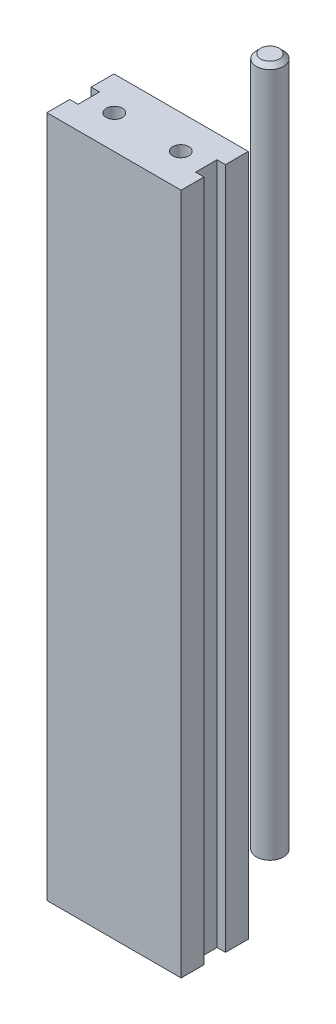
ISO-10303-21;
HEADER;
FILE_DESCRIPTION(('STEP AP214'),'2;1');
FILE_NAME('part.step','',(''),(''),'','','');
FILE_SCHEMA(('AUTOMOTIVE_DESIGN { 1 0 10303 214 1 1 1 1 }'));
ENDSEC;
DATA;
#1=APPLICATION_CONTEXT('core data for automotive mechanical design processes');
#2=APPLICATION_PROTOCOL_DEFINITION('international standard','automotive_design',2000,#1);
#3=PRODUCT_CONTEXT('',#1,'mechanical');
#4=PRODUCT('Part','Part','',(#3));
#5=PRODUCT_RELATED_PRODUCT_CATEGORY('part','',(#4));
#6=PRODUCT_DEFINITION_FORMATION('','',#4);
#7=PRODUCT_DEFINITION_CONTEXT('part definition',#1,'design');
#8=PRODUCT_DEFINITION('design','',#6,#7);
#9=PRODUCT_DEFINITION_SHAPE('','',#8);
#10=(LENGTH_UNIT() NAMED_UNIT(*) SI_UNIT(.MILLI.,.METRE.));
#11=(NAMED_UNIT(*) PLANE_ANGLE_UNIT() SI_UNIT($,.RADIAN.));
#12=(NAMED_UNIT(*) SI_UNIT($,.STERADIAN.) SOLID_ANGLE_UNIT());
#13=UNCERTAINTY_MEASURE_WITH_UNIT(LENGTH_MEASURE(1.E-05),#10,'distance_accuracy_value','');
#14=(GEOMETRIC_REPRESENTATION_CONTEXT(3) GLOBAL_UNCERTAINTY_ASSIGNED_CONTEXT((#13)) GLOBAL_UNIT_ASSIGNED_CONTEXT((#10,
#11,#12)) REPRESENTATION_CONTEXT('',''));
#15=CARTESIAN_POINT('',(0.,0.,0.));
#16=DIRECTION('',(0.,0.,1.));
#17=DIRECTION('',(1.,0.,0.));
#18=AXIS2_PLACEMENT_3D('',#15,#16,#17);
#19=CARTESIAN_POINT('',(0.,103.6,-36.45));
#20=DIRECTION('',(0.,-1.,0.));
#21=DIRECTION('',(0.,0.,-1.));
#22=AXIS2_PLACEMENT_3D('',#19,#20,#21);
#23=CYLINDRICAL_SURFACE('',#22,4.05);
#24=CARTESIAN_POINT('',(0.,102.33,-36.45));
#25=DIRECTION('',(0.,1.,0.));
#26=DIRECTION('',(0.,0.,1.));
#27=AXIS2_PLACEMENT_3D('',#24,#25,#26);
#28=CIRCLE('',#27,4.05);
#29=CARTESIAN_POINT('',(0.,102.33,-32.4));
#30=VERTEX_POINT('',#29);
#31=EDGE_CURVE('E11',#30,#30,#28,.F.);
#32=ORIENTED_EDGE('',*,*,#31,.T.);
#33=EDGE_LOOP('',(#32));
#34=FACE_BOUND('',#33,.T.);
#35=CARTESIAN_POINT('',(0.,-101.6,-36.45));
#36=DIRECTION('',(0.,1.,0.));
#37=DIRECTION('',(0.,0.,1.));
#38=AXIS2_PLACEMENT_3D('',#35,#36,#37);
#39=CIRCLE('',#38,4.05);
#40=CARTESIAN_POINT('',(0.,-101.6,-32.4));
#41=VERTEX_POINT('',#40);
#42=EDGE_CURVE('E61',#41,#41,#39,.F.);
#43=ORIENTED_EDGE('',*,*,#42,.F.);
#44=EDGE_LOOP('',(#43));
#45=FACE_BOUND('',#44,.T.);
#46=ADVANCED_FACE('F49',(#34,#45),#23,.T.);
#47=CARTESIAN_POINT('',(0.,103.6,-36.45));
#48=DIRECTION('',(0.,1.,0.));
#49=DIRECTION('',(0.,0.,1.));
#50=AXIS2_PLACEMENT_3D('',#47,#48,#49);
#51=PLANE('',#50);
#52=CARTESIAN_POINT('',(0.,103.6,-36.45));
#53=DIRECTION('',(0.,1.,0.));
#54=DIRECTION('',(0.,0.,1.));
#55=AXIS2_PLACEMENT_3D('',#52,#53,#54);
#56=CIRCLE('',#55,2.78);
#57=CARTESIAN_POINT('',(0.,103.6,-33.67));
#58=VERTEX_POINT('',#57);
#59=EDGE_CURVE('E57',#58,#58,#56,.T.);
#60=ORIENTED_EDGE('',*,*,#59,.T.);
#61=EDGE_LOOP('',(#60));
#62=FACE_BOUND('',#61,.T.);
#63=ADVANCED_FACE('F71',(#62),#51,.T.);
#64=CARTESIAN_POINT('',(0.,-101.6,0.));
#65=DIRECTION('',(0.,1.,0.));
#66=DIRECTION('',(0.,0.,1.));
#67=AXIS2_PLACEMENT_3D('',#64,#65,#66);
#68=PLANE('',#67);
#69=ORIENTED_EDGE('',*,*,#42,.T.);
#70=EDGE_LOOP('',(#69));
#71=FACE_BOUND('',#70,.T.);
#72=ADVANCED_FACE('F68',(#71),#68,.F.);
#73=CARTESIAN_POINT('',(0.,103.6,-36.45));
#74=DIRECTION('',(0.,-1.,0.));
#75=DIRECTION('',(0.,0.,-1.));
#76=AXIS2_PLACEMENT_3D('',#73,#74,#75);
#77=CONICAL_SURFACE('',#76,2.78,0.785398163397449);
#78=ORIENTED_EDGE('',*,*,#31,.F.);
#79=EDGE_LOOP('',(#78));
#80=FACE_BOUND('',#79,.T.);
#81=ORIENTED_EDGE('',*,*,#59,.F.);
#82=EDGE_LOOP('',(#81));
#83=FACE_BOUND('',#82,.T.);
#84=ADVANCED_FACE('F52',(#80,#83),#77,.T.);
#85=CLOSED_SHELL('',(#46,#63,#72,#84));
#86=MANIFOLD_SOLID_BREP('B2',#85);
#87=CARTESIAN_POINT('',(-20.,101.6,-10.));
#88=DIRECTION('',(1.,0.,0.));
#89=DIRECTION('',(0.,0.,-1.));
#90=AXIS2_PLACEMENT_3D('',#87,#88,#89);
#91=PLANE('',#90);
#92=DIRECTION('',(0.,0.,1.));
#93=VECTOR('',#92,1.);
#94=CARTESIAN_POINT('',(-20.,-101.6,-10.));
#95=LINE('',#94,#93);
#96=CARTESIAN_POINT('',(-20.,-101.6,-10.));
#97=VERTEX_POINT('',#96);
#98=CARTESIAN_POINT('',(-20.,-101.6,-3.2));
#99=VERTEX_POINT('',#98);
#100=EDGE_CURVE('E218',#97,#99,#95,.T.);
#101=ORIENTED_EDGE('',*,*,#100,.T.);
#102=DIRECTION('',(0.,1.,0.));
#103=VECTOR('',#102,1.);
#104=CARTESIAN_POINT('',(-20.,-101.6,-3.2));
#105=LINE('',#104,#103);
#106=CARTESIAN_POINT('',(-20.,101.6,-3.2));
#107=VERTEX_POINT('',#106);
#108=EDGE_CURVE('E219',#99,#107,#105,.T.);
#109=ORIENTED_EDGE('',*,*,#108,.T.);
#110=DIRECTION('',(0.,0.,1.));
#111=VECTOR('',#110,1.);
#112=CARTESIAN_POINT('',(-20.,101.6,-10.));
#113=LINE('',#112,#111);
#114=CARTESIAN_POINT('',(-20.,101.6,-10.));
#115=VERTEX_POINT('',#114);
#116=EDGE_CURVE('E267',#115,#107,#113,.T.);
#117=ORIENTED_EDGE('',*,*,#116,.F.);
#118=DIRECTION('',(0.,-1.,0.));
#119=VECTOR('',#118,1.);
#120=CARTESIAN_POINT('',(-20.,101.6,-10.));
#121=LINE('',#120,#119);
#122=EDGE_CURVE('E236',#115,#97,#121,.T.);
#123=ORIENTED_EDGE('',*,*,#122,.T.);
#124=EDGE_LOOP('',(#101,#109,#117,#123));
#125=FACE_BOUND('',#124,.T.);
#126=ADVANCED_FACE('F108',(#125),#91,.F.);
#127=CARTESIAN_POINT('',(20.,101.6,-10.));
#128=DIRECTION('',(-1.,0.,0.));
#129=DIRECTION('',(0.,0.,1.));
#130=AXIS2_PLACEMENT_3D('',#127,#128,#129);
#131=PLANE('',#130);
#132=DIRECTION('',(0.,0.,-1.));
#133=VECTOR('',#132,1.);
#134=CARTESIAN_POINT('',(20.,101.6,-10.));
#135=LINE('',#134,#133);
#136=CARTESIAN_POINT('',(20.,101.6,-3.20000000000001));
#137=VERTEX_POINT('',#136);
#138=CARTESIAN_POINT('',(20.,101.6,-10.));
#139=VERTEX_POINT('',#138);
#140=EDGE_CURVE('E271',#137,#139,#135,.T.);
#141=ORIENTED_EDGE('',*,*,#140,.F.);
#142=DIRECTION('',(0.,1.,0.));
#143=VECTOR('',#142,1.);
#144=CARTESIAN_POINT('',(20.,-101.6,-3.20000000000001));
#145=LINE('',#144,#143);
#146=CARTESIAN_POINT('',(20.,-101.6,-3.20000000000001));
#147=VERTEX_POINT('',#146);
#148=EDGE_CURVE('E307',#147,#137,#145,.T.);
#149=ORIENTED_EDGE('',*,*,#148,.F.);
#150=DIRECTION('',(0.,0.,-1.));
#151=VECTOR('',#150,1.);
#152=CARTESIAN_POINT('',(20.,-101.6,-10.));
#153=LINE('',#152,#151);
#154=CARTESIAN_POINT('',(20.,-101.6,-10.));
#155=VERTEX_POINT('',#154);
#156=EDGE_CURVE('E230',#147,#155,#153,.T.);
#157=ORIENTED_EDGE('',*,*,#156,.T.);
#158=DIRECTION('',(0.,-1.,0.));
#159=VECTOR('',#158,1.);
#160=CARTESIAN_POINT('',(20.,101.6,-10.));
#161=LINE('',#160,#159);
#162=EDGE_CURVE('E239',#139,#155,#161,.T.);
#163=ORIENTED_EDGE('',*,*,#162,.F.);
#164=EDGE_LOOP('',(#141,#149,#157,#163));
#165=FACE_BOUND('',#164,.T.);
#166=ADVANCED_FACE('F285',(#165),#131,.F.);
#167=CARTESIAN_POINT('',(-20.,101.6,3.2));
#168=VERTEX_POINT('',#167);
#169=CARTESIAN_POINT('',(-20.,101.6,10.));
#170=VERTEX_POINT('',#169);
#171=EDGE_CURVE('E212',#168,#170,#113,.T.);
#172=ORIENTED_EDGE('',*,*,#171,.F.);
#173=DIRECTION('',(0.,1.,0.));
#174=VECTOR('',#173,1.);
#175=CARTESIAN_POINT('',(-20.,-101.6,3.2));
#176=LINE('',#175,#174);
#177=CARTESIAN_POINT('',(-20.,-101.6,3.2));
#178=VERTEX_POINT('',#177);
#179=EDGE_CURVE('E200',#178,#168,#176,.T.);
#180=ORIENTED_EDGE('',*,*,#179,.F.);
#181=CARTESIAN_POINT('',(-20.,-101.6,10.));
#182=VERTEX_POINT('',#181);
#183=EDGE_CURVE('E210',#178,#182,#95,.T.);
#184=ORIENTED_EDGE('',*,*,#183,.T.);
#185=DIRECTION('',(0.,-1.,0.));
#186=VECTOR('',#185,1.);
#187=CARTESIAN_POINT('',(-20.,101.6,10.));
#188=LINE('',#187,#186);
#189=EDGE_CURVE('E47',#170,#182,#188,.T.);
#190=ORIENTED_EDGE('',*,*,#189,.F.);
#191=EDGE_LOOP('',(#172,#180,#184,#190));
#192=FACE_BOUND('',#191,.T.);
#193=ADVANCED_FACE('F110',(#192),#91,.F.);
#194=CARTESIAN_POINT('',(-20.,101.6,10.));
#195=DIRECTION('',(0.,0.,-1.));
#196=DIRECTION('',(-1.,0.,0.));
#197=AXIS2_PLACEMENT_3D('',#194,#195,#196);
#198=PLANE('',#197);
#199=DIRECTION('',(1.,0.,0.));
#200=VECTOR('',#199,1.);
#201=CARTESIAN_POINT('',(-20.,-101.6,10.));
#202=LINE('',#201,#200);
#203=CARTESIAN_POINT('',(20.,-101.6,10.));
#204=VERTEX_POINT('',#203);
#205=EDGE_CURVE('E217',#182,#204,#202,.T.);
#206=ORIENTED_EDGE('',*,*,#205,.T.);
#207=DIRECTION('',(0.,-1.,0.));
#208=VECTOR('',#207,1.);
#209=CARTESIAN_POINT('',(20.,101.6,10.));
#210=LINE('',#209,#208);
#211=CARTESIAN_POINT('',(20.,101.6,10.));
#212=VERTEX_POINT('',#211);
#213=EDGE_CURVE('E116',#212,#204,#210,.T.);
#214=ORIENTED_EDGE('',*,*,#213,.F.);
#215=DIRECTION('',(1.,0.,0.));
#216=VECTOR('',#215,1.);
#217=CARTESIAN_POINT('',(-20.,101.6,10.));
#218=LINE('',#217,#216);
#219=EDGE_CURVE('E270',#170,#212,#218,.T.);
#220=ORIENTED_EDGE('',*,*,#219,.F.);
#221=ORIENTED_EDGE('',*,*,#189,.T.);
#222=EDGE_LOOP('',(#206,#214,#220,#221));
#223=FACE_BOUND('',#222,.T.);
#224=ADVANCED_FACE('F362',(#223),#198,.F.);
#225=CARTESIAN_POINT('',(20.,-101.6,3.2));
#226=VERTEX_POINT('',#225);
#227=EDGE_CURVE('E231',#204,#226,#153,.T.);
#228=ORIENTED_EDGE('',*,*,#227,.T.);
#229=DIRECTION('',(0.,1.,0.));
#230=VECTOR('',#229,1.);
#231=CARTESIAN_POINT('',(20.,-101.6,3.2));
#232=LINE('',#231,#230);
#233=CARTESIAN_POINT('',(20.,101.6,3.2));
#234=VERTEX_POINT('',#233);
#235=EDGE_CURVE('E305',#226,#234,#232,.T.);
#236=ORIENTED_EDGE('',*,*,#235,.T.);
#237=EDGE_CURVE('E248',#212,#234,#135,.T.);
#238=ORIENTED_EDGE('',*,*,#237,.F.);
#239=ORIENTED_EDGE('',*,*,#213,.T.);
#240=EDGE_LOOP('',(#228,#236,#238,#239));
#241=FACE_BOUND('',#240,.T.);
#242=ADVANCED_FACE('F245',(#241),#131,.F.);
#243=CARTESIAN_POINT('',(-20.,101.6,-10.));
#244=DIRECTION('',(0.,0.,1.));
#245=DIRECTION('',(1.,0.,0.));
#246=AXIS2_PLACEMENT_3D('',#243,#244,#245);
#247=PLANE('',#246);
#248=DIRECTION('',(-1.,0.,0.));
#249=VECTOR('',#248,1.);
#250=CARTESIAN_POINT('',(-20.,-101.6,-10.));
#251=LINE('',#250,#249);
#252=EDGE_CURVE('E234',#155,#97,#251,.T.);
#253=ORIENTED_EDGE('',*,*,#252,.T.);
#254=ORIENTED_EDGE('',*,*,#122,.F.);
#255=DIRECTION('',(-1.,0.,0.));
#256=VECTOR('',#255,1.);
#257=CARTESIAN_POINT('',(-20.,101.6,-10.));
#258=LINE('',#257,#256);
#259=EDGE_CURVE('E227',#139,#115,#258,.T.);
#260=ORIENTED_EDGE('',*,*,#259,.F.);
#261=ORIENTED_EDGE('',*,*,#162,.T.);
#262=EDGE_LOOP('',(#253,#254,#260,#261));
#263=FACE_BOUND('',#262,.T.);
#264=ADVANCED_FACE('F289',(#263),#247,.F.);
#265=CARTESIAN_POINT('',(0.,101.6,0.));
#266=DIRECTION('',(0.,1.,0.));
#267=DIRECTION('',(0.,0.,1.));
#268=AXIS2_PLACEMENT_3D('',#265,#266,#267);
#269=PLANE('',#268);
#270=CARTESIAN_POINT('',(-9.9,101.6,0.));
#271=DIRECTION('',(0.,1.,0.));
#272=DIRECTION('',(0.,0.,1.));
#273=AXIS2_PLACEMENT_3D('',#270,#271,#272);
#274=CIRCLE('',#273,2.4);
#275=CARTESIAN_POINT('',(-9.9,101.6,2.4));
#276=VERTEX_POINT('',#275);
#277=EDGE_CURVE('E324',#276,#276,#274,.T.);
#278=ORIENTED_EDGE('',*,*,#277,.F.);
#279=EDGE_LOOP('',(#278));
#280=FACE_BOUND('',#279,.T.);
#281=CARTESIAN_POINT('',(9.9,101.6,0.));
#282=DIRECTION('',(0.,1.,0.));
#283=DIRECTION('',(0.,0.,1.));
#284=AXIS2_PLACEMENT_3D('',#281,#282,#283);
#285=CIRCLE('',#284,2.4);
#286=CARTESIAN_POINT('',(9.9,101.6,2.4));
#287=VERTEX_POINT('',#286);
#288=EDGE_CURVE('E321',#287,#287,#285,.T.);
#289=ORIENTED_EDGE('',*,*,#288,.F.);
#290=EDGE_LOOP('',(#289));
#291=FACE_BOUND('',#290,.T.);
#292=DIRECTION('',(-1.,0.,0.));
#293=VECTOR('',#292,1.);
#294=CARTESIAN_POINT('',(-20.,101.6,-3.2));
#295=LINE('',#294,#293);
#296=CARTESIAN_POINT('',(-17.5,101.6,-3.2));
#297=VERTEX_POINT('',#296);
#298=EDGE_CURVE('E205',#297,#107,#295,.T.);
#299=ORIENTED_EDGE('',*,*,#298,.F.);
#300=DIRECTION('',(0.,0.,-1.));
#301=VECTOR('',#300,1.);
#302=CARTESIAN_POINT('',(-17.5,101.6,-3.2));
#303=LINE('',#302,#301);
#304=CARTESIAN_POINT('',(-17.5,101.6,3.2));
#305=VERTEX_POINT('',#304);
#306=EDGE_CURVE('E295',#305,#297,#303,.T.);
#307=ORIENTED_EDGE('',*,*,#306,.F.);
#308=DIRECTION('',(1.,0.,0.));
#309=VECTOR('',#308,1.);
#310=CARTESIAN_POINT('',(-20.,101.6,3.2));
#311=LINE('',#310,#309);
#312=EDGE_CURVE('E298',#168,#305,#311,.T.);
#313=ORIENTED_EDGE('',*,*,#312,.F.);
#314=ORIENTED_EDGE('',*,*,#171,.T.);
#315=ORIENTED_EDGE('',*,*,#219,.T.);
#316=ORIENTED_EDGE('',*,*,#237,.T.);
#317=DIRECTION('',(1.,0.,0.));
#318=VECTOR('',#317,1.);
#319=CARTESIAN_POINT('',(20.,101.6,3.2));
#320=LINE('',#319,#318);
#321=CARTESIAN_POINT('',(17.5,101.6,3.2));
#322=VERTEX_POINT('',#321);
#323=EDGE_CURVE('E266',#322,#234,#320,.T.);
#324=ORIENTED_EDGE('',*,*,#323,.F.);
#325=DIRECTION('',(0.,0.,1.));
#326=VECTOR('',#325,1.);
#327=CARTESIAN_POINT('',(17.5,101.6,-3.2));
#328=LINE('',#327,#326);
#329=CARTESIAN_POINT('',(17.5,101.6,-3.2));
#330=VERTEX_POINT('',#329);
#331=EDGE_CURVE('E310',#330,#322,#328,.T.);
#332=ORIENTED_EDGE('',*,*,#331,.F.);
#333=DIRECTION('',(-1.,0.,0.));
#334=VECTOR('',#333,1.);
#335=CARTESIAN_POINT('',(20.,101.6,-3.20000000000001));
#336=LINE('',#335,#334);
#337=EDGE_CURVE('E262',#137,#330,#336,.T.);
#338=ORIENTED_EDGE('',*,*,#337,.F.);
#339=ORIENTED_EDGE('',*,*,#140,.T.);
#340=ORIENTED_EDGE('',*,*,#259,.T.);
#341=ORIENTED_EDGE('',*,*,#116,.T.);
#342=EDGE_LOOP('',(#299,#307,#313,#314,#315,#316,#324,#332,#338,#339,#340,#341));
#343=FACE_BOUND('',#342,.T.);
#344=ADVANCED_FACE('F278',(#280,#291,#343),#269,.T.);
#345=CARTESIAN_POINT('',(0.,-101.6,0.));
#346=DIRECTION('',(0.,1.,0.));
#347=DIRECTION('',(0.,0.,1.));
#348=AXIS2_PLACEMENT_3D('',#345,#346,#347);
#349=PLANE('',#348);
#350=CARTESIAN_POINT('',(-9.9,-101.6,0.));
#351=DIRECTION('',(0.,1.,0.));
#352=DIRECTION('',(0.,0.,1.));
#353=AXIS2_PLACEMENT_3D('',#350,#351,#352);
#354=CIRCLE('',#353,2.4);
#355=CARTESIAN_POINT('',(-9.9,-101.6,2.4));
#356=VERTEX_POINT('',#355);
#357=EDGE_CURVE('E309',#356,#356,#354,.T.);
#358=ORIENTED_EDGE('',*,*,#357,.T.);
#359=EDGE_LOOP('',(#358));
#360=FACE_BOUND('',#359,.T.);
#361=CARTESIAN_POINT('',(9.9,-101.6,0.));
#362=DIRECTION('',(0.,1.,0.));
#363=DIRECTION('',(0.,0.,1.));
#364=AXIS2_PLACEMENT_3D('',#361,#362,#363);
#365=CIRCLE('',#364,2.4);
#366=CARTESIAN_POINT('',(9.9,-101.6,2.4));
#367=VERTEX_POINT('',#366);
#368=EDGE_CURVE('E318',#367,#367,#365,.T.);
#369=ORIENTED_EDGE('',*,*,#368,.T.);
#370=EDGE_LOOP('',(#369));
#371=FACE_BOUND('',#370,.T.);
#372=DIRECTION('',(0.,0.,-1.));
#373=VECTOR('',#372,1.);
#374=CARTESIAN_POINT('',(-17.5,-101.6,-3.2));
#375=LINE('',#374,#373);
#376=CARTESIAN_POINT('',(-17.5,-101.6,3.2));
#377=VERTEX_POINT('',#376);
#378=CARTESIAN_POINT('',(-17.5,-101.6,-3.2));
#379=VERTEX_POINT('',#378);
#380=EDGE_CURVE('E123',#377,#379,#375,.T.);
#381=ORIENTED_EDGE('',*,*,#380,.T.);
#382=DIRECTION('',(-1.,0.,0.));
#383=VECTOR('',#382,1.);
#384=CARTESIAN_POINT('',(-20.,-101.6,-3.2));
#385=LINE('',#384,#383);
#386=EDGE_CURVE('E213',#379,#99,#385,.T.);
#387=ORIENTED_EDGE('',*,*,#386,.T.);
#388=ORIENTED_EDGE('',*,*,#100,.F.);
#389=ORIENTED_EDGE('',*,*,#252,.F.);
#390=ORIENTED_EDGE('',*,*,#156,.F.);
#391=DIRECTION('',(-1.,0.,0.));
#392=VECTOR('',#391,1.);
#393=CARTESIAN_POINT('',(20.,-101.6,-3.20000000000001));
#394=LINE('',#393,#392);
#395=CARTESIAN_POINT('',(17.5,-101.6,-3.2));
#396=VERTEX_POINT('',#395);
#397=EDGE_CURVE('E257',#147,#396,#394,.T.);
#398=ORIENTED_EDGE('',*,*,#397,.T.);
#399=DIRECTION('',(0.,0.,1.));
#400=VECTOR('',#399,1.);
#401=CARTESIAN_POINT('',(17.5,-101.6,-3.2));
#402=LINE('',#401,#400);
#403=CARTESIAN_POINT('',(17.5,-101.6,3.2));
#404=VERTEX_POINT('',#403);
#405=EDGE_CURVE('E254',#396,#404,#402,.T.);
#406=ORIENTED_EDGE('',*,*,#405,.T.);
#407=DIRECTION('',(1.,0.,0.));
#408=VECTOR('',#407,1.);
#409=CARTESIAN_POINT('',(20.,-101.6,3.2));
#410=LINE('',#409,#408);
#411=EDGE_CURVE('E131',#404,#226,#410,.T.);
#412=ORIENTED_EDGE('',*,*,#411,.T.);
#413=ORIENTED_EDGE('',*,*,#227,.F.);
#414=ORIENTED_EDGE('',*,*,#205,.F.);
#415=ORIENTED_EDGE('',*,*,#183,.F.);
#416=DIRECTION('',(1.,0.,0.));
#417=VECTOR('',#416,1.);
#418=CARTESIAN_POINT('',(-20.,-101.6,3.2));
#419=LINE('',#418,#417);
#420=EDGE_CURVE('E196',#178,#377,#419,.T.);
#421=ORIENTED_EDGE('',*,*,#420,.T.);
#422=EDGE_LOOP('',(#381,#387,#388,#389,#390,#398,#406,#412,#413,#414,#415,#421));
#423=FACE_BOUND('',#422,.T.);
#424=ADVANCED_FACE('F215',(#360,#371,#423),#349,.F.);
#425=CARTESIAN_POINT('',(20.,-101.6,-3.20000000000001));
#426=DIRECTION('',(0.,0.,-1.));
#427=DIRECTION('',(-1.,0.,0.));
#428=AXIS2_PLACEMENT_3D('',#425,#426,#427);
#429=PLANE('',#428);
#430=ORIENTED_EDGE('',*,*,#337,.T.);
#431=DIRECTION('',(0.,1.,0.));
#432=VECTOR('',#431,1.);
#433=CARTESIAN_POINT('',(17.5,-101.6,-3.2));
#434=LINE('',#433,#432);
#435=EDGE_CURVE('E255',#396,#330,#434,.T.);
#436=ORIENTED_EDGE('',*,*,#435,.F.);
#437=ORIENTED_EDGE('',*,*,#397,.F.);
#438=ORIENTED_EDGE('',*,*,#148,.T.);
#439=EDGE_LOOP('',(#430,#436,#437,#438));
#440=FACE_BOUND('',#439,.T.);
#441=ADVANCED_FACE('F371',(#440),#429,.F.);
#442=CARTESIAN_POINT('',(20.,-101.6,3.2));
#443=DIRECTION('',(0.,0.,1.));
#444=DIRECTION('',(1.,0.,0.));
#445=AXIS2_PLACEMENT_3D('',#442,#443,#444);
#446=PLANE('',#445);
#447=ORIENTED_EDGE('',*,*,#323,.T.);
#448=ORIENTED_EDGE('',*,*,#235,.F.);
#449=ORIENTED_EDGE('',*,*,#411,.F.);
#450=DIRECTION('',(0.,1.,0.));
#451=VECTOR('',#450,1.);
#452=CARTESIAN_POINT('',(17.5,-101.6,3.2));
#453=LINE('',#452,#451);
#454=EDGE_CURVE('E259',#404,#322,#453,.T.);
#455=ORIENTED_EDGE('',*,*,#454,.T.);
#456=EDGE_LOOP('',(#447,#448,#449,#455));
#457=FACE_BOUND('',#456,.T.);
#458=ADVANCED_FACE('F373',(#457),#446,.F.);
#459=CARTESIAN_POINT('',(17.5,-101.6,-3.2));
#460=DIRECTION('',(-1.,0.,0.));
#461=DIRECTION('',(0.,0.,1.));
#462=AXIS2_PLACEMENT_3D('',#459,#460,#461);
#463=PLANE('',#462);
#464=ORIENTED_EDGE('',*,*,#331,.T.);
#465=ORIENTED_EDGE('',*,*,#454,.F.);
#466=ORIENTED_EDGE('',*,*,#405,.F.);
#467=ORIENTED_EDGE('',*,*,#435,.T.);
#468=EDGE_LOOP('',(#464,#465,#466,#467));
#469=FACE_BOUND('',#468,.T.);
#470=ADVANCED_FACE('F376',(#469),#463,.F.);
#471=CARTESIAN_POINT('',(-20.,-101.6,-3.2));
#472=DIRECTION('',(0.,0.,-1.));
#473=DIRECTION('',(-1.,0.,0.));
#474=AXIS2_PLACEMENT_3D('',#471,#472,#473);
#475=PLANE('',#474);
#476=ORIENTED_EDGE('',*,*,#298,.T.);
#477=ORIENTED_EDGE('',*,*,#108,.F.);
#478=ORIENTED_EDGE('',*,*,#386,.F.);
#479=DIRECTION('',(0.,1.,0.));
#480=VECTOR('',#479,1.);
#481=CARTESIAN_POINT('',(-17.5,-101.6,-3.2));
#482=LINE('',#481,#480);
#483=EDGE_CURVE('E223',#379,#297,#482,.T.);
#484=ORIENTED_EDGE('',*,*,#483,.T.);
#485=EDGE_LOOP('',(#476,#477,#478,#484));
#486=FACE_BOUND('',#485,.T.);
#487=ADVANCED_FACE('F379',(#486),#475,.F.);
#488=CARTESIAN_POINT('',(-17.5,-101.6,-3.2));
#489=DIRECTION('',(1.,0.,0.));
#490=DIRECTION('',(0.,0.,-1.));
#491=AXIS2_PLACEMENT_3D('',#488,#489,#490);
#492=PLANE('',#491);
#493=ORIENTED_EDGE('',*,*,#306,.T.);
#494=ORIENTED_EDGE('',*,*,#483,.F.);
#495=ORIENTED_EDGE('',*,*,#380,.F.);
#496=DIRECTION('',(0.,1.,0.));
#497=VECTOR('',#496,1.);
#498=CARTESIAN_POINT('',(-17.5,-101.6,3.2));
#499=LINE('',#498,#497);
#500=EDGE_CURVE('E202',#377,#305,#499,.T.);
#501=ORIENTED_EDGE('',*,*,#500,.T.);
#502=EDGE_LOOP('',(#493,#494,#495,#501));
#503=FACE_BOUND('',#502,.T.);
#504=ADVANCED_FACE('F351',(#503),#492,.F.);
#505=CARTESIAN_POINT('',(-20.,-101.6,3.2));
#506=DIRECTION('',(0.,0.,1.));
#507=DIRECTION('',(1.,0.,0.));
#508=AXIS2_PLACEMENT_3D('',#505,#506,#507);
#509=PLANE('',#508);
#510=ORIENTED_EDGE('',*,*,#312,.T.);
#511=ORIENTED_EDGE('',*,*,#500,.F.);
#512=ORIENTED_EDGE('',*,*,#420,.F.);
#513=ORIENTED_EDGE('',*,*,#179,.T.);
#514=EDGE_LOOP('',(#510,#511,#512,#513));
#515=FACE_BOUND('',#514,.T.);
#516=ADVANCED_FACE('F199',(#515),#509,.F.);
#517=CARTESIAN_POINT('',(9.9,-101.6,0.));
#518=DIRECTION('',(0.,1.,0.));
#519=DIRECTION('',(0.,0.,1.));
#520=AXIS2_PLACEMENT_3D('',#517,#518,#519);
#521=CYLINDRICAL_SURFACE('',#520,2.4);
#522=ORIENTED_EDGE('',*,*,#368,.F.);
#523=EDGE_LOOP('',(#522));
#524=FACE_BOUND('',#523,.T.);
#525=ORIENTED_EDGE('',*,*,#288,.T.);
#526=EDGE_LOOP('',(#525));
#527=FACE_BOUND('',#526,.T.);
#528=ADVANCED_FACE('F335',(#524,#527),#521,.F.);
#529=CARTESIAN_POINT('',(-9.9,-101.6,0.));
#530=DIRECTION('',(0.,1.,0.));
#531=DIRECTION('',(0.,0.,1.));
#532=AXIS2_PLACEMENT_3D('',#529,#530,#531);
#533=CYLINDRICAL_SURFACE('',#532,2.4);
#534=ORIENTED_EDGE('',*,*,#357,.F.);
#535=EDGE_LOOP('',(#534));
#536=FACE_BOUND('',#535,.T.);
#537=ORIENTED_EDGE('',*,*,#277,.T.);
#538=EDGE_LOOP('',(#537));
#539=FACE_BOUND('',#538,.T.);
#540=ADVANCED_FACE('F332',(#536,#539),#533,.F.);
#541=CLOSED_SHELL('',(#126,#166,#193,#224,#242,#264,#344,#424,#441,#458,#470,#487,#504,#516,
#528,#540));
#542=MANIFOLD_SOLID_BREP('B6',#541);
#543=ADVANCED_BREP_SHAPE_REPRESENTATION('',(#18,#86,#542),#14);
#544=SHAPE_DEFINITION_REPRESENTATION(#9,#543);
ENDSEC;
END-ISO-10303-21;
